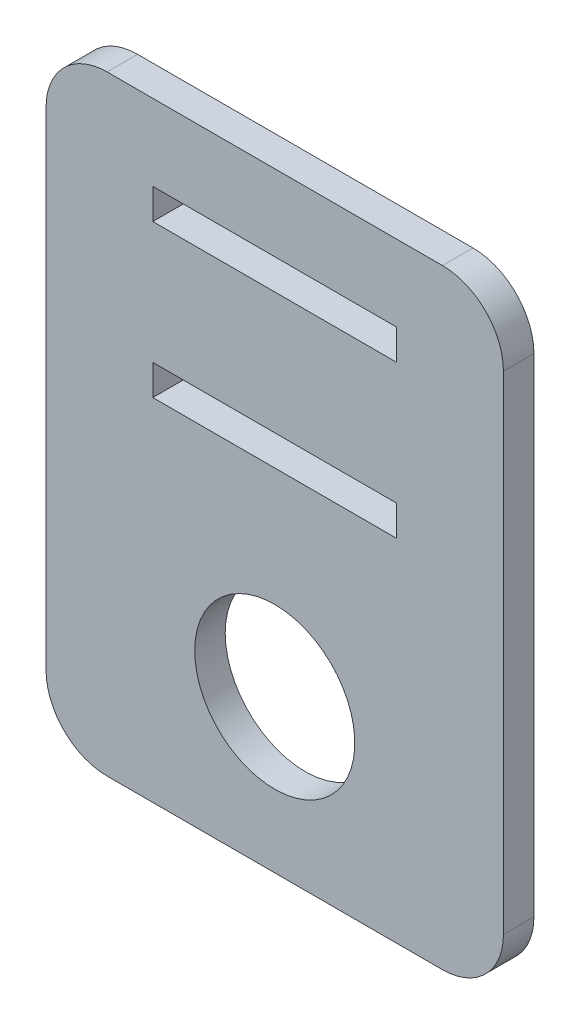
ISO-10303-21;
HEADER;
FILE_DESCRIPTION(('STEP AP214'),'2;1');
FILE_NAME('part.step','',(''),(''),'','','');
FILE_SCHEMA(('AUTOMOTIVE_DESIGN { 1 0 10303 214 1 1 1 1 }'));
ENDSEC;
DATA;
#1=APPLICATION_CONTEXT('core data for automotive mechanical design processes');
#2=APPLICATION_PROTOCOL_DEFINITION('international standard','automotive_design',2000,#1);
#3=PRODUCT_CONTEXT('',#1,'mechanical');
#4=PRODUCT('Part','Part','',(#3));
#5=PRODUCT_RELATED_PRODUCT_CATEGORY('part','',(#4));
#6=PRODUCT_DEFINITION_FORMATION('','',#4);
#7=PRODUCT_DEFINITION_CONTEXT('part definition',#1,'design');
#8=PRODUCT_DEFINITION('design','',#6,#7);
#9=PRODUCT_DEFINITION_SHAPE('','',#8);
#10=(LENGTH_UNIT() NAMED_UNIT(*) SI_UNIT(.MILLI.,.METRE.));
#11=(NAMED_UNIT(*) PLANE_ANGLE_UNIT() SI_UNIT($,.RADIAN.));
#12=(NAMED_UNIT(*) SI_UNIT($,.STERADIAN.) SOLID_ANGLE_UNIT());
#13=UNCERTAINTY_MEASURE_WITH_UNIT(LENGTH_MEASURE(1.E-05),#10,'distance_accuracy_value','');
#14=(GEOMETRIC_REPRESENTATION_CONTEXT(3) GLOBAL_UNCERTAINTY_ASSIGNED_CONTEXT((#13)) GLOBAL_UNIT_ASSIGNED_CONTEXT((#10,
#11,#12)) REPRESENTATION_CONTEXT('',''));
#15=CARTESIAN_POINT('',(0.,0.,0.));
#16=DIRECTION('',(0.,0.,1.));
#17=DIRECTION('',(1.,0.,0.));
#18=AXIS2_PLACEMENT_3D('',#15,#16,#17);
#19=CARTESIAN_POINT('',(0.,0.,0.));
#20=DIRECTION('',(0.,0.,1.));
#21=DIRECTION('',(1.,0.,0.));
#22=AXIS2_PLACEMENT_3D('',#19,#20,#21);
#23=PLANE('',#22);
#24=DIRECTION('',(0.,-1.,0.));
#25=VECTOR('',#24,1.);
#26=CARTESIAN_POINT('',(-7.5,10.,0.));
#27=LINE('',#26,#25);
#28=CARTESIAN_POINT('',(-7.5,8.,0.));
#29=VERTEX_POINT('',#28);
#30=CARTESIAN_POINT('',(-7.5,-8.,0.));
#31=VERTEX_POINT('',#30);
#32=EDGE_CURVE('E87',#29,#31,#27,.T.);
#33=ORIENTED_EDGE('',*,*,#32,.F.);
#34=CARTESIAN_POINT('',(-5.5,8.,0.));
#35=DIRECTION('',(0.,0.,1.));
#36=DIRECTION('',(1.,0.,0.));
#37=AXIS2_PLACEMENT_3D('',#34,#35,#36);
#38=CIRCLE('',#37,2.);
#39=CARTESIAN_POINT('',(-5.5,10.,0.));
#40=VERTEX_POINT('',#39);
#41=EDGE_CURVE('E99',#40,#29,#38,.T.);
#42=ORIENTED_EDGE('',*,*,#41,.F.);
#43=DIRECTION('',(1.,0.,0.));
#44=VECTOR('',#43,1.);
#45=CARTESIAN_POINT('',(7.50000000000001,10.,0.));
#46=LINE('',#45,#44);
#47=CARTESIAN_POINT('',(5.50000000000001,10.,0.));
#48=VERTEX_POINT('',#47);
#49=EDGE_CURVE('E112',#48,#40,#46,.F.);
#50=ORIENTED_EDGE('',*,*,#49,.F.);
#51=CARTESIAN_POINT('',(5.50000000000001,8.,0.));
#52=DIRECTION('',(0.,0.,1.));
#53=DIRECTION('',(1.,0.,0.));
#54=AXIS2_PLACEMENT_3D('',#51,#52,#53);
#55=CIRCLE('',#54,2.);
#56=CARTESIAN_POINT('',(7.50000000000001,8.,0.));
#57=VERTEX_POINT('',#56);
#58=EDGE_CURVE('E139',#57,#48,#55,.T.);
#59=ORIENTED_EDGE('',*,*,#58,.F.);
#60=DIRECTION('',(0.,1.,0.));
#61=VECTOR('',#60,1.);
#62=CARTESIAN_POINT('',(7.5,-10.,0.));
#63=LINE('',#62,#61);
#64=CARTESIAN_POINT('',(7.5,-8.00000000000001,0.));
#65=VERTEX_POINT('',#64);
#66=EDGE_CURVE('E116',#65,#57,#63,.T.);
#67=ORIENTED_EDGE('',*,*,#66,.F.);
#68=CARTESIAN_POINT('',(5.5,-8.00000000000001,0.));
#69=DIRECTION('',(0.,0.,1.));
#70=DIRECTION('',(1.,0.,0.));
#71=AXIS2_PLACEMENT_3D('',#68,#69,#70);
#72=CIRCLE('',#71,2.);
#73=CARTESIAN_POINT('',(5.5,-10.,0.));
#74=VERTEX_POINT('',#73);
#75=EDGE_CURVE('E141',#74,#65,#72,.T.);
#76=ORIENTED_EDGE('',*,*,#75,.F.);
#77=DIRECTION('',(1.,0.,0.));
#78=VECTOR('',#77,1.);
#79=CARTESIAN_POINT('',(-7.5,-10.,0.));
#80=LINE('',#79,#78);
#81=CARTESIAN_POINT('',(-5.5,-10.,0.));
#82=VERTEX_POINT('',#81);
#83=EDGE_CURVE('E89',#82,#74,#80,.T.);
#84=ORIENTED_EDGE('',*,*,#83,.F.);
#85=CARTESIAN_POINT('',(-5.5,-8.,0.));
#86=DIRECTION('',(0.,0.,1.));
#87=DIRECTION('',(1.,0.,0.));
#88=AXIS2_PLACEMENT_3D('',#85,#86,#87);
#89=CIRCLE('',#88,2.);
#90=EDGE_CURVE('E82',#31,#82,#89,.T.);
#91=ORIENTED_EDGE('',*,*,#90,.F.);
#92=EDGE_LOOP('',(#33,#42,#50,#59,#67,#76,#84,#91));
#93=FACE_BOUND('',#92,.T.);
#94=CARTESIAN_POINT('',(0.,-5.,0.));
#95=DIRECTION('',(0.,0.,-1.));
#96=DIRECTION('',(-1.,0.,0.));
#97=AXIS2_PLACEMENT_3D('',#94,#95,#96);
#98=CIRCLE('',#97,2.625);
#99=CARTESIAN_POINT('',(-2.625,-5.,0.));
#100=VERTEX_POINT('',#99);
#101=EDGE_CURVE('E19',#100,#100,#98,.F.);
#102=ORIENTED_EDGE('',*,*,#101,.T.);
#103=EDGE_LOOP('',(#102));
#104=FACE_BOUND('',#103,.T.);
#105=DIRECTION('',(1.,0.,0.));
#106=VECTOR('',#105,1.);
#107=CARTESIAN_POINT('',(4.,6.5,0.));
#108=LINE('',#107,#106);
#109=CARTESIAN_POINT('',(-4.,6.5,0.));
#110=VERTEX_POINT('',#109);
#111=CARTESIAN_POINT('',(4.,6.5,0.));
#112=VERTEX_POINT('',#111);
#113=EDGE_CURVE('E152',#110,#112,#108,.T.);
#114=ORIENTED_EDGE('',*,*,#113,.T.);
#115=DIRECTION('',(0.,1.,0.));
#116=VECTOR('',#115,1.);
#117=CARTESIAN_POINT('',(4.,7.5,0.));
#118=LINE('',#117,#116);
#119=CARTESIAN_POINT('',(4.,7.5,0.));
#120=VERTEX_POINT('',#119);
#121=EDGE_CURVE('E161',#112,#120,#118,.T.);
#122=ORIENTED_EDGE('',*,*,#121,.T.);
#123=DIRECTION('',(1.,0.,0.));
#124=VECTOR('',#123,1.);
#125=CARTESIAN_POINT('',(-4.,7.5,0.));
#126=LINE('',#125,#124);
#127=CARTESIAN_POINT('',(-4.,7.5,0.));
#128=VERTEX_POINT('',#127);
#129=EDGE_CURVE('E167',#120,#128,#126,.F.);
#130=ORIENTED_EDGE('',*,*,#129,.T.);
#131=DIRECTION('',(0.,1.,0.));
#132=VECTOR('',#131,1.);
#133=CARTESIAN_POINT('',(-4.,6.5,0.));
#134=LINE('',#133,#132);
#135=EDGE_CURVE('E173',#128,#110,#134,.F.);
#136=ORIENTED_EDGE('',*,*,#135,.T.);
#137=EDGE_LOOP('',(#114,#122,#130,#136));
#138=FACE_BOUND('',#137,.T.);
#139=DIRECTION('',(1.,0.,0.));
#140=VECTOR('',#139,1.);
#141=CARTESIAN_POINT('',(4.,1.5,0.));
#142=LINE('',#141,#140);
#143=CARTESIAN_POINT('',(-4.,1.5,0.));
#144=VERTEX_POINT('',#143);
#145=CARTESIAN_POINT('',(4.,1.5,0.));
#146=VERTEX_POINT('',#145);
#147=EDGE_CURVE('E176',#144,#146,#142,.T.);
#148=ORIENTED_EDGE('',*,*,#147,.T.);
#149=DIRECTION('',(0.,1.,0.));
#150=VECTOR('',#149,1.);
#151=CARTESIAN_POINT('',(4.,2.5,0.));
#152=LINE('',#151,#150);
#153=CARTESIAN_POINT('',(4.,2.5,0.));
#154=VERTEX_POINT('',#153);
#155=EDGE_CURVE('E185',#146,#154,#152,.T.);
#156=ORIENTED_EDGE('',*,*,#155,.T.);
#157=DIRECTION('',(1.,0.,0.));
#158=VECTOR('',#157,1.);
#159=CARTESIAN_POINT('',(-4.,2.5,0.));
#160=LINE('',#159,#158);
#161=CARTESIAN_POINT('',(-4.,2.5,0.));
#162=VERTEX_POINT('',#161);
#163=EDGE_CURVE('E191',#154,#162,#160,.F.);
#164=ORIENTED_EDGE('',*,*,#163,.T.);
#165=DIRECTION('',(0.,1.,0.));
#166=VECTOR('',#165,1.);
#167=CARTESIAN_POINT('',(-4.,1.5,0.));
#168=LINE('',#167,#166);
#169=EDGE_CURVE('E110',#162,#144,#168,.F.);
#170=ORIENTED_EDGE('',*,*,#169,.T.);
#171=EDGE_LOOP('',(#148,#156,#164,#170));
#172=FACE_BOUND('',#171,.T.);
#173=ADVANCED_FACE('F16',(#93,#104,#138,#172),#23,.F.);
#174=CARTESIAN_POINT('',(-4.,1.5,1.));
#175=DIRECTION('',(-1.,0.,0.));
#176=DIRECTION('',(0.,0.,1.));
#177=AXIS2_PLACEMENT_3D('',#174,#175,#176);
#178=PLANE('',#177);
#179=DIRECTION('',(0.,0.,1.));
#180=VECTOR('',#179,1.);
#181=CARTESIAN_POINT('',(-4.,2.5,1.));
#182=LINE('',#181,#180);
#183=CARTESIAN_POINT('',(-4.,2.5,1.));
#184=VERTEX_POINT('',#183);
#185=EDGE_CURVE('E193',#162,#184,#182,.T.);
#186=ORIENTED_EDGE('',*,*,#185,.T.);
#187=DIRECTION('',(0.,1.,0.));
#188=VECTOR('',#187,1.);
#189=CARTESIAN_POINT('',(-4.,0.,1.));
#190=LINE('',#189,#188);
#191=CARTESIAN_POINT('',(-4.,1.5,1.));
#192=VERTEX_POINT('',#191);
#193=EDGE_CURVE('E102',#192,#184,#190,.T.);
#194=ORIENTED_EDGE('',*,*,#193,.F.);
#195=DIRECTION('',(0.,0.,1.));
#196=VECTOR('',#195,1.);
#197=CARTESIAN_POINT('',(-4.,1.5,1.));
#198=LINE('',#197,#196);
#199=EDGE_CURVE('E179',#192,#144,#198,.F.);
#200=ORIENTED_EDGE('',*,*,#199,.T.);
#201=ORIENTED_EDGE('',*,*,#169,.F.);
#202=EDGE_LOOP('',(#186,#194,#200,#201));
#203=FACE_BOUND('',#202,.T.);
#204=ADVANCED_FACE('F212',(#203),#178,.F.);
#205=CARTESIAN_POINT('',(-4.,2.5,1.));
#206=DIRECTION('',(0.,1.,0.));
#207=DIRECTION('',(0.,0.,1.));
#208=AXIS2_PLACEMENT_3D('',#205,#206,#207);
#209=PLANE('',#208);
#210=DIRECTION('',(0.,0.,-1.));
#211=VECTOR('',#210,1.);
#212=CARTESIAN_POINT('',(4.,2.5,1.));
#213=LINE('',#212,#211);
#214=CARTESIAN_POINT('',(4.,2.5,1.));
#215=VERTEX_POINT('',#214);
#216=EDGE_CURVE('E188',#154,#215,#213,.F.);
#217=ORIENTED_EDGE('',*,*,#216,.T.);
#218=DIRECTION('',(1.,0.,0.));
#219=VECTOR('',#218,1.);
#220=CARTESIAN_POINT('',(0.,2.5,1.));
#221=LINE('',#220,#219);
#222=EDGE_CURVE('E105',#184,#215,#221,.T.);
#223=ORIENTED_EDGE('',*,*,#222,.F.);
#224=ORIENTED_EDGE('',*,*,#185,.F.);
#225=ORIENTED_EDGE('',*,*,#163,.F.);
#226=EDGE_LOOP('',(#217,#223,#224,#225));
#227=FACE_BOUND('',#226,.T.);
#228=ADVANCED_FACE('F251',(#227),#209,.F.);
#229=CARTESIAN_POINT('',(4.,2.5,1.));
#230=DIRECTION('',(1.,0.,0.));
#231=DIRECTION('',(0.,0.,-1.));
#232=AXIS2_PLACEMENT_3D('',#229,#230,#231);
#233=PLANE('',#232);
#234=DIRECTION('',(0.,0.,1.));
#235=VECTOR('',#234,1.);
#236=CARTESIAN_POINT('',(4.,1.5,1.));
#237=LINE('',#236,#235);
#238=CARTESIAN_POINT('',(4.,1.5,1.));
#239=VERTEX_POINT('',#238);
#240=EDGE_CURVE('E182',#146,#239,#237,.T.);
#241=ORIENTED_EDGE('',*,*,#240,.T.);
#242=DIRECTION('',(0.,1.,0.));
#243=VECTOR('',#242,1.);
#244=CARTESIAN_POINT('',(4.,0.,1.));
#245=LINE('',#244,#243);
#246=EDGE_CURVE('E228',#215,#239,#245,.F.);
#247=ORIENTED_EDGE('',*,*,#246,.F.);
#248=ORIENTED_EDGE('',*,*,#216,.F.);
#249=ORIENTED_EDGE('',*,*,#155,.F.);
#250=EDGE_LOOP('',(#241,#247,#248,#249));
#251=FACE_BOUND('',#250,.T.);
#252=ADVANCED_FACE('F225',(#251),#233,.F.);
#253=CARTESIAN_POINT('',(4.,1.5,1.));
#254=DIRECTION('',(0.,-1.,0.));
#255=DIRECTION('',(1.,0.,0.));
#256=AXIS2_PLACEMENT_3D('',#253,#254,#255);
#257=PLANE('',#256);
#258=ORIENTED_EDGE('',*,*,#199,.F.);
#259=DIRECTION('',(1.,0.,0.));
#260=VECTOR('',#259,1.);
#261=CARTESIAN_POINT('',(0.,1.5,1.));
#262=LINE('',#261,#260);
#263=EDGE_CURVE('E218',#239,#192,#262,.F.);
#264=ORIENTED_EDGE('',*,*,#263,.F.);
#265=ORIENTED_EDGE('',*,*,#240,.F.);
#266=ORIENTED_EDGE('',*,*,#147,.F.);
#267=EDGE_LOOP('',(#258,#264,#265,#266));
#268=FACE_BOUND('',#267,.T.);
#269=ADVANCED_FACE('F216',(#268),#257,.F.);
#270=CARTESIAN_POINT('',(-4.,6.5,1.));
#271=DIRECTION('',(-1.,0.,0.));
#272=DIRECTION('',(0.,0.,1.));
#273=AXIS2_PLACEMENT_3D('',#270,#271,#272);
#274=PLANE('',#273);
#275=DIRECTION('',(0.,0.,1.));
#276=VECTOR('',#275,1.);
#277=CARTESIAN_POINT('',(-4.,7.5,1.));
#278=LINE('',#277,#276);
#279=CARTESIAN_POINT('',(-4.,7.5,1.));
#280=VERTEX_POINT('',#279);
#281=EDGE_CURVE('E170',#128,#280,#278,.T.);
#282=ORIENTED_EDGE('',*,*,#281,.T.);
#283=DIRECTION('',(0.,1.,0.));
#284=VECTOR('',#283,1.);
#285=CARTESIAN_POINT('',(-4.,0.,1.));
#286=LINE('',#285,#284);
#287=CARTESIAN_POINT('',(-4.,6.5,1.));
#288=VERTEX_POINT('',#287);
#289=EDGE_CURVE('E255',#288,#280,#286,.T.);
#290=ORIENTED_EDGE('',*,*,#289,.F.);
#291=DIRECTION('',(0.,0.,-1.));
#292=VECTOR('',#291,1.);
#293=CARTESIAN_POINT('',(-4.,6.5,1.));
#294=LINE('',#293,#292);
#295=EDGE_CURVE('E155',#288,#110,#294,.T.);
#296=ORIENTED_EDGE('',*,*,#295,.T.);
#297=ORIENTED_EDGE('',*,*,#135,.F.);
#298=EDGE_LOOP('',(#282,#290,#296,#297));
#299=FACE_BOUND('',#298,.T.);
#300=ADVANCED_FACE('F302',(#299),#274,.F.);
#301=CARTESIAN_POINT('',(-4.,7.5,1.));
#302=DIRECTION('',(0.,1.,0.));
#303=DIRECTION('',(0.,0.,1.));
#304=AXIS2_PLACEMENT_3D('',#301,#302,#303);
#305=PLANE('',#304);
#306=DIRECTION('',(0.,0.,-1.));
#307=VECTOR('',#306,1.);
#308=CARTESIAN_POINT('',(4.,7.5,1.));
#309=LINE('',#308,#307);
#310=CARTESIAN_POINT('',(4.,7.5,1.));
#311=VERTEX_POINT('',#310);
#312=EDGE_CURVE('E164',#120,#311,#309,.F.);
#313=ORIENTED_EDGE('',*,*,#312,.T.);
#314=DIRECTION('',(1.,0.,0.));
#315=VECTOR('',#314,1.);
#316=CARTESIAN_POINT('',(0.,7.5,1.));
#317=LINE('',#316,#315);
#318=EDGE_CURVE('E258',#280,#311,#317,.T.);
#319=ORIENTED_EDGE('',*,*,#318,.F.);
#320=ORIENTED_EDGE('',*,*,#281,.F.);
#321=ORIENTED_EDGE('',*,*,#129,.F.);
#322=EDGE_LOOP('',(#313,#319,#320,#321));
#323=FACE_BOUND('',#322,.T.);
#324=ADVANCED_FACE('F299',(#323),#305,.F.);
#325=CARTESIAN_POINT('',(4.,7.5,1.));
#326=DIRECTION('',(1.,0.,0.));
#327=DIRECTION('',(0.,0.,-1.));
#328=AXIS2_PLACEMENT_3D('',#325,#326,#327);
#329=PLANE('',#328);
#330=DIRECTION('',(0.,0.,-1.));
#331=VECTOR('',#330,1.);
#332=CARTESIAN_POINT('',(4.,6.5,1.));
#333=LINE('',#332,#331);
#334=CARTESIAN_POINT('',(4.,6.5,1.));
#335=VERTEX_POINT('',#334);
#336=EDGE_CURVE('E158',#112,#335,#333,.F.);
#337=ORIENTED_EDGE('',*,*,#336,.T.);
#338=DIRECTION('',(0.,1.,0.));
#339=VECTOR('',#338,1.);
#340=CARTESIAN_POINT('',(4.,0.,1.));
#341=LINE('',#340,#339);
#342=EDGE_CURVE('E289',#311,#335,#341,.F.);
#343=ORIENTED_EDGE('',*,*,#342,.F.);
#344=ORIENTED_EDGE('',*,*,#312,.F.);
#345=ORIENTED_EDGE('',*,*,#121,.F.);
#346=EDGE_LOOP('',(#337,#343,#344,#345));
#347=FACE_BOUND('',#346,.T.);
#348=ADVANCED_FACE('F308',(#347),#329,.F.);
#349=CARTESIAN_POINT('',(4.,6.5,1.));
#350=DIRECTION('',(0.,-1.,0.));
#351=DIRECTION('',(0.,0.,-1.));
#352=AXIS2_PLACEMENT_3D('',#349,#350,#351);
#353=PLANE('',#352);
#354=ORIENTED_EDGE('',*,*,#295,.F.);
#355=DIRECTION('',(1.,0.,0.));
#356=VECTOR('',#355,1.);
#357=CARTESIAN_POINT('',(0.,6.5,1.));
#358=LINE('',#357,#356);
#359=EDGE_CURVE('E137',#335,#288,#358,.F.);
#360=ORIENTED_EDGE('',*,*,#359,.F.);
#361=ORIENTED_EDGE('',*,*,#336,.F.);
#362=ORIENTED_EDGE('',*,*,#113,.F.);
#363=EDGE_LOOP('',(#354,#360,#361,#362));
#364=FACE_BOUND('',#363,.T.);
#365=ADVANCED_FACE('F312',(#364),#353,.F.);
#366=CARTESIAN_POINT('',(0.,-5.,1.));
#367=DIRECTION('',(0.,0.,-1.));
#368=DIRECTION('',(-1.,0.,0.));
#369=AXIS2_PLACEMENT_3D('',#366,#367,#368);
#370=CYLINDRICAL_SURFACE('',#369,2.625);
#371=CARTESIAN_POINT('',(0.,-5.,1.));
#372=DIRECTION('',(0.,0.,-1.));
#373=DIRECTION('',(-1.,0.,0.));
#374=AXIS2_PLACEMENT_3D('',#371,#372,#373);
#375=CIRCLE('',#374,2.625);
#376=CARTESIAN_POINT('',(-2.625,-5.,1.));
#377=VERTEX_POINT('',#376);
#378=EDGE_CURVE('E134',#377,#377,#375,.T.);
#379=ORIENTED_EDGE('',*,*,#378,.F.);
#380=EDGE_LOOP('',(#379));
#381=FACE_BOUND('',#380,.T.);
#382=ORIENTED_EDGE('',*,*,#101,.F.);
#383=EDGE_LOOP('',(#382));
#384=FACE_BOUND('',#383,.T.);
#385=ADVANCED_FACE('F314',(#381,#384),#370,.F.);
#386=CARTESIAN_POINT('',(-5.5,-8.,0.));
#387=DIRECTION('',(0.,0.,1.));
#388=DIRECTION('',(1.,0.,0.));
#389=AXIS2_PLACEMENT_3D('',#386,#387,#388);
#390=CYLINDRICAL_SURFACE('',#389,2.);
#391=ORIENTED_EDGE('',*,*,#90,.T.);
#392=DIRECTION('',(0.,0.,1.));
#393=VECTOR('',#392,1.);
#394=CARTESIAN_POINT('',(-5.5,-10.,0.));
#395=LINE('',#394,#393);
#396=CARTESIAN_POINT('',(-5.5,-10.,1.));
#397=VERTEX_POINT('',#396);
#398=EDGE_CURVE('E92',#397,#82,#395,.F.);
#399=ORIENTED_EDGE('',*,*,#398,.F.);
#400=CARTESIAN_POINT('',(-5.5,-8.,1.));
#401=DIRECTION('',(0.,0.,1.));
#402=DIRECTION('',(1.,0.,0.));
#403=AXIS2_PLACEMENT_3D('',#400,#401,#402);
#404=CIRCLE('',#403,2.);
#405=CARTESIAN_POINT('',(-7.5,-8.,1.));
#406=VERTEX_POINT('',#405);
#407=EDGE_CURVE('E97',#406,#397,#404,.T.);
#408=ORIENTED_EDGE('',*,*,#407,.F.);
#409=DIRECTION('',(0.,0.,1.));
#410=VECTOR('',#409,1.);
#411=CARTESIAN_POINT('',(-7.5,-8.,0.));
#412=LINE('',#411,#410);
#413=EDGE_CURVE('E94',#31,#406,#412,.T.);
#414=ORIENTED_EDGE('',*,*,#413,.F.);
#415=EDGE_LOOP('',(#391,#399,#408,#414));
#416=FACE_BOUND('',#415,.T.);
#417=ADVANCED_FACE('F95',(#416),#390,.T.);
#418=CARTESIAN_POINT('',(-7.5,-10.,0.));
#419=DIRECTION('',(0.,-1.,0.));
#420=DIRECTION('',(1.,0.,0.));
#421=AXIS2_PLACEMENT_3D('',#418,#419,#420);
#422=PLANE('',#421);
#423=DIRECTION('',(0.,0.,1.));
#424=VECTOR('',#423,1.);
#425=CARTESIAN_POINT('',(5.5,-10.,0.));
#426=LINE('',#425,#424);
#427=CARTESIAN_POINT('',(5.5,-10.,1.));
#428=VERTEX_POINT('',#427);
#429=EDGE_CURVE('E121',#428,#74,#426,.F.);
#430=ORIENTED_EDGE('',*,*,#429,.F.);
#431=DIRECTION('',(1.,0.,0.));
#432=VECTOR('',#431,1.);
#433=CARTESIAN_POINT('',(0.,-10.,1.));
#434=LINE('',#433,#432);
#435=EDGE_CURVE('E132',#397,#428,#434,.T.);
#436=ORIENTED_EDGE('',*,*,#435,.F.);
#437=ORIENTED_EDGE('',*,*,#398,.T.);
#438=ORIENTED_EDGE('',*,*,#83,.T.);
#439=EDGE_LOOP('',(#430,#436,#437,#438));
#440=FACE_BOUND('',#439,.T.);
#441=ADVANCED_FACE('F343',(#440),#422,.T.);
#442=CARTESIAN_POINT('',(5.5,-8.00000000000001,0.));
#443=DIRECTION('',(0.,0.,1.));
#444=DIRECTION('',(1.,0.,0.));
#445=AXIS2_PLACEMENT_3D('',#442,#443,#444);
#446=CYLINDRICAL_SURFACE('',#445,2.);
#447=ORIENTED_EDGE('',*,*,#75,.T.);
#448=DIRECTION('',(0.,0.,1.));
#449=VECTOR('',#448,1.);
#450=CARTESIAN_POINT('',(7.5,-8.00000000000001,0.));
#451=LINE('',#450,#449);
#452=CARTESIAN_POINT('',(7.5,-8.00000000000001,1.));
#453=VERTEX_POINT('',#452);
#454=EDGE_CURVE('E119',#453,#65,#451,.F.);
#455=ORIENTED_EDGE('',*,*,#454,.F.);
#456=CARTESIAN_POINT('',(5.5,-8.00000000000001,1.));
#457=DIRECTION('',(0.,0.,1.));
#458=DIRECTION('',(1.,0.,0.));
#459=AXIS2_PLACEMENT_3D('',#456,#457,#458);
#460=CIRCLE('',#459,2.);
#461=EDGE_CURVE('E129',#428,#453,#460,.T.);
#462=ORIENTED_EDGE('',*,*,#461,.F.);
#463=ORIENTED_EDGE('',*,*,#429,.T.);
#464=EDGE_LOOP('',(#447,#455,#462,#463));
#465=FACE_BOUND('',#464,.T.);
#466=ADVANCED_FACE('F340',(#465),#446,.T.);
#467=CARTESIAN_POINT('',(7.5,-10.,0.));
#468=DIRECTION('',(1.,0.,0.));
#469=DIRECTION('',(0.,1.,0.));
#470=AXIS2_PLACEMENT_3D('',#467,#468,#469);
#471=PLANE('',#470);
#472=DIRECTION('',(0.,0.,1.));
#473=VECTOR('',#472,1.);
#474=CARTESIAN_POINT('',(7.50000000000001,8.,0.));
#475=LINE('',#474,#473);
#476=CARTESIAN_POINT('',(7.50000000000001,8.,1.));
#477=VERTEX_POINT('',#476);
#478=EDGE_CURVE('E118',#477,#57,#475,.F.);
#479=ORIENTED_EDGE('',*,*,#478,.F.);
#480=DIRECTION('',(0.,1.,0.));
#481=VECTOR('',#480,1.);
#482=CARTESIAN_POINT('',(7.5,0.,1.));
#483=LINE('',#482,#481);
#484=EDGE_CURVE('E128',#453,#477,#483,.T.);
#485=ORIENTED_EDGE('',*,*,#484,.F.);
#486=ORIENTED_EDGE('',*,*,#454,.T.);
#487=ORIENTED_EDGE('',*,*,#66,.T.);
#488=EDGE_LOOP('',(#479,#485,#486,#487));
#489=FACE_BOUND('',#488,.T.);
#490=ADVANCED_FACE('F275',(#489),#471,.T.);
#491=CARTESIAN_POINT('',(5.50000000000001,8.,0.));
#492=DIRECTION('',(0.,0.,1.));
#493=DIRECTION('',(1.,0.,0.));
#494=AXIS2_PLACEMENT_3D('',#491,#492,#493);
#495=CYLINDRICAL_SURFACE('',#494,2.);
#496=ORIENTED_EDGE('',*,*,#58,.T.);
#497=DIRECTION('',(0.,0.,1.));
#498=VECTOR('',#497,1.);
#499=CARTESIAN_POINT('',(5.50000000000001,10.,0.));
#500=LINE('',#499,#498);
#501=CARTESIAN_POINT('',(5.50000000000001,10.,1.));
#502=VERTEX_POINT('',#501);
#503=EDGE_CURVE('E115',#502,#48,#500,.F.);
#504=ORIENTED_EDGE('',*,*,#503,.F.);
#505=CARTESIAN_POINT('',(5.50000000000001,8.,1.));
#506=DIRECTION('',(0.,0.,1.));
#507=DIRECTION('',(1.,0.,0.));
#508=AXIS2_PLACEMENT_3D('',#505,#506,#507);
#509=CIRCLE('',#508,2.);
#510=EDGE_CURVE('E125',#477,#502,#509,.T.);
#511=ORIENTED_EDGE('',*,*,#510,.F.);
#512=ORIENTED_EDGE('',*,*,#478,.T.);
#513=EDGE_LOOP('',(#496,#504,#511,#512));
#514=FACE_BOUND('',#513,.T.);
#515=ADVANCED_FACE('F269',(#514),#495,.T.);
#516=CARTESIAN_POINT('',(7.50000000000001,10.,0.));
#517=DIRECTION('',(0.,1.,0.));
#518=DIRECTION('',(0.,0.,1.));
#519=AXIS2_PLACEMENT_3D('',#516,#517,#518);
#520=PLANE('',#519);
#521=ORIENTED_EDGE('',*,*,#503,.T.);
#522=ORIENTED_EDGE('',*,*,#49,.T.);
#523=DIRECTION('',(0.,0.,1.));
#524=VECTOR('',#523,1.);
#525=CARTESIAN_POINT('',(-5.5,10.,0.));
#526=LINE('',#525,#524);
#527=CARTESIAN_POINT('',(-5.5,10.,1.));
#528=VERTEX_POINT('',#527);
#529=EDGE_CURVE('E114',#528,#40,#526,.F.);
#530=ORIENTED_EDGE('',*,*,#529,.F.);
#531=DIRECTION('',(1.,0.,0.));
#532=VECTOR('',#531,1.);
#533=CARTESIAN_POINT('',(0.,10.,1.));
#534=LINE('',#533,#532);
#535=EDGE_CURVE('E124',#502,#528,#534,.F.);
#536=ORIENTED_EDGE('',*,*,#535,.F.);
#537=EDGE_LOOP('',(#521,#522,#530,#536));
#538=FACE_BOUND('',#537,.T.);
#539=ADVANCED_FACE('F278',(#538),#520,.T.);
#540=CARTESIAN_POINT('',(-5.5,8.,0.));
#541=DIRECTION('',(0.,0.,1.));
#542=DIRECTION('',(1.,0.,0.));
#543=AXIS2_PLACEMENT_3D('',#540,#541,#542);
#544=CYLINDRICAL_SURFACE('',#543,2.);
#545=ORIENTED_EDGE('',*,*,#41,.T.);
#546=DIRECTION('',(0.,0.,1.));
#547=VECTOR('',#546,1.);
#548=CARTESIAN_POINT('',(-7.5,8.,0.));
#549=LINE('',#548,#547);
#550=CARTESIAN_POINT('',(-7.5,8.,1.));
#551=VERTEX_POINT('',#550);
#552=EDGE_CURVE('E34',#551,#29,#549,.F.);
#553=ORIENTED_EDGE('',*,*,#552,.F.);
#554=CARTESIAN_POINT('',(-5.5,8.,1.));
#555=DIRECTION('',(0.,0.,1.));
#556=DIRECTION('',(1.,0.,0.));
#557=AXIS2_PLACEMENT_3D('',#554,#555,#556);
#558=CIRCLE('',#557,2.);
#559=EDGE_CURVE('E25',#528,#551,#558,.T.);
#560=ORIENTED_EDGE('',*,*,#559,.F.);
#561=ORIENTED_EDGE('',*,*,#529,.T.);
#562=EDGE_LOOP('',(#545,#553,#560,#561));
#563=FACE_BOUND('',#562,.T.);
#564=ADVANCED_FACE('F329',(#563),#544,.T.);
#565=CARTESIAN_POINT('',(-7.5,10.,0.));
#566=DIRECTION('',(-1.,0.,0.));
#567=DIRECTION('',(0.,-1.,0.));
#568=AXIS2_PLACEMENT_3D('',#565,#566,#567);
#569=PLANE('',#568);
#570=ORIENTED_EDGE('',*,*,#552,.T.);
#571=ORIENTED_EDGE('',*,*,#32,.T.);
#572=ORIENTED_EDGE('',*,*,#413,.T.);
#573=DIRECTION('',(0.,1.,0.));
#574=VECTOR('',#573,1.);
#575=CARTESIAN_POINT('',(-7.5,0.,1.));
#576=LINE('',#575,#574);
#577=EDGE_CURVE('E11',#551,#406,#576,.F.);
#578=ORIENTED_EDGE('',*,*,#577,.F.);
#579=EDGE_LOOP('',(#570,#571,#572,#578));
#580=FACE_BOUND('',#579,.T.);
#581=ADVANCED_FACE('F101',(#580),#569,.T.);
#582=CARTESIAN_POINT('',(0.,0.,1.));
#583=DIRECTION('',(0.,0.,1.));
#584=DIRECTION('',(1.,0.,0.));
#585=AXIS2_PLACEMENT_3D('',#582,#583,#584);
#586=PLANE('',#585);
#587=ORIENTED_EDGE('',*,*,#559,.T.);
#588=ORIENTED_EDGE('',*,*,#577,.T.);
#589=ORIENTED_EDGE('',*,*,#407,.T.);
#590=ORIENTED_EDGE('',*,*,#435,.T.);
#591=ORIENTED_EDGE('',*,*,#461,.T.);
#592=ORIENTED_EDGE('',*,*,#484,.T.);
#593=ORIENTED_EDGE('',*,*,#510,.T.);
#594=ORIENTED_EDGE('',*,*,#535,.T.);
#595=EDGE_LOOP('',(#587,#588,#589,#590,#591,#592,#593,#594));
#596=FACE_BOUND('',#595,.T.);
#597=ORIENTED_EDGE('',*,*,#378,.T.);
#598=EDGE_LOOP('',(#597));
#599=FACE_BOUND('',#598,.T.);
#600=ORIENTED_EDGE('',*,*,#342,.T.);
#601=ORIENTED_EDGE('',*,*,#359,.T.);
#602=ORIENTED_EDGE('',*,*,#289,.T.);
#603=ORIENTED_EDGE('',*,*,#318,.T.);
#604=EDGE_LOOP('',(#600,#601,#602,#603));
#605=FACE_BOUND('',#604,.T.);
#606=ORIENTED_EDGE('',*,*,#246,.T.);
#607=ORIENTED_EDGE('',*,*,#263,.T.);
#608=ORIENTED_EDGE('',*,*,#193,.T.);
#609=ORIENTED_EDGE('',*,*,#222,.T.);
#610=EDGE_LOOP('',(#606,#607,#608,#609));
#611=FACE_BOUND('',#610,.T.);
#612=ADVANCED_FACE('F254',(#596,#599,#605,#611),#586,.T.);
#613=CLOSED_SHELL('',(#173,#204,#228,#252,#269,#300,#324,#348,#365,#385,#417,#441,#466,#490,
#515,#539,#564,#581,#612));
#614=MANIFOLD_SOLID_BREP('B1',#613);
#615=ADVANCED_BREP_SHAPE_REPRESENTATION('',(#18,#614),#14);
#616=SHAPE_DEFINITION_REPRESENTATION(#9,#615);
ENDSEC;
END-ISO-10303-21;
